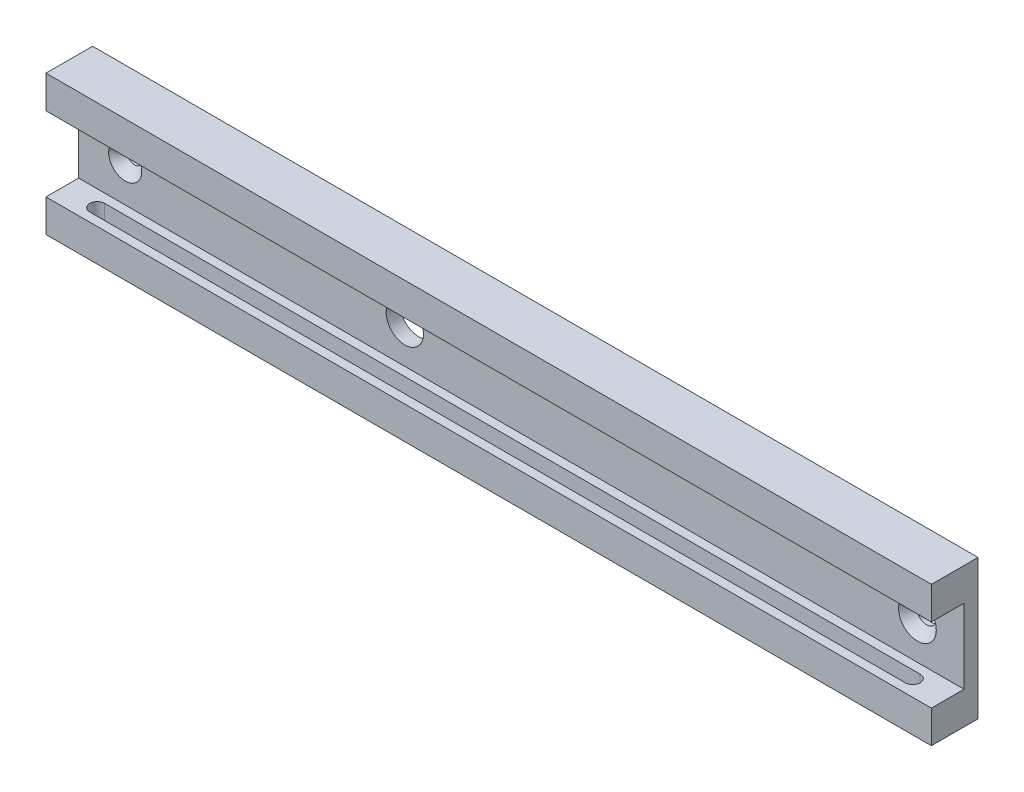
ISO-10303-21;
HEADER;
FILE_DESCRIPTION(('STEP AP214'),'2;1');
FILE_NAME('part.step','',(''),(''),'','','');
FILE_SCHEMA(('AUTOMOTIVE_DESIGN { 1 0 10303 214 1 1 1 1 }'));
ENDSEC;
DATA;
#1=APPLICATION_CONTEXT('core data for automotive mechanical design processes');
#2=APPLICATION_PROTOCOL_DEFINITION('international standard','automotive_design',2000,#1);
#3=PRODUCT_CONTEXT('',#1,'mechanical');
#4=PRODUCT('Part','Part','',(#3));
#5=PRODUCT_RELATED_PRODUCT_CATEGORY('part','',(#4));
#6=PRODUCT_DEFINITION_FORMATION('','',#4);
#7=PRODUCT_DEFINITION_CONTEXT('part definition',#1,'design');
#8=PRODUCT_DEFINITION('design','',#6,#7);
#9=PRODUCT_DEFINITION_SHAPE('','',#8);
#10=(LENGTH_UNIT() NAMED_UNIT(*) SI_UNIT(.MILLI.,.METRE.));
#11=(NAMED_UNIT(*) PLANE_ANGLE_UNIT() SI_UNIT($,.RADIAN.));
#12=(NAMED_UNIT(*) SI_UNIT($,.STERADIAN.) SOLID_ANGLE_UNIT());
#13=UNCERTAINTY_MEASURE_WITH_UNIT(LENGTH_MEASURE(1.E-05),#10,'distance_accuracy_value','');
#14=(GEOMETRIC_REPRESENTATION_CONTEXT(3) GLOBAL_UNCERTAINTY_ASSIGNED_CONTEXT((#13)) GLOBAL_UNIT_ASSIGNED_CONTEXT((#10,
#11,#12)) REPRESENTATION_CONTEXT('',''));
#15=CARTESIAN_POINT('',(0.,0.,0.));
#16=DIRECTION('',(0.,0.,1.));
#17=DIRECTION('',(1.,0.,0.));
#18=AXIS2_PLACEMENT_3D('',#15,#16,#17);
#19=CARTESIAN_POINT('',(0.,0.,10.));
#20=DIRECTION('',(0.,0.,-1.));
#21=DIRECTION('',(-1.,0.,0.));
#22=AXIS2_PLACEMENT_3D('',#19,#20,#21);
#23=PLANE('',#22);
#24=DIRECTION('',(0.,-1.,0.));
#25=VECTOR('',#24,1.);
#26=CARTESIAN_POINT('',(0.,0.,10.));
#27=LINE('',#26,#25);
#28=CARTESIAN_POINT('',(0.,30.,10.));
#29=VERTEX_POINT('',#28);
#30=CARTESIAN_POINT('',(0.,23.,10.));
#31=VERTEX_POINT('',#30);
#32=EDGE_CURVE('E176',#29,#31,#27,.T.);
#33=ORIENTED_EDGE('',*,*,#32,.T.);
#34=DIRECTION('',(1.,0.,0.));
#35=VECTOR('',#34,1.);
#36=CARTESIAN_POINT('',(0.,23.,10.));
#37=LINE('',#36,#35);
#38=CARTESIAN_POINT('',(190.,23.,10.));
#39=VERTEX_POINT('',#38);
#40=EDGE_CURVE('E167',#31,#39,#37,.T.);
#41=ORIENTED_EDGE('',*,*,#40,.T.);
#42=DIRECTION('',(0.,1.,0.));
#43=VECTOR('',#42,1.);
#44=CARTESIAN_POINT('',(190.,0.,10.));
#45=LINE('',#44,#43);
#46=CARTESIAN_POINT('',(190.,30.,10.));
#47=VERTEX_POINT('',#46);
#48=EDGE_CURVE('E182',#39,#47,#45,.T.);
#49=ORIENTED_EDGE('',*,*,#48,.T.);
#50=DIRECTION('',(-1.,0.,0.));
#51=VECTOR('',#50,1.);
#52=CARTESIAN_POINT('',(0.,30.,10.));
#53=LINE('',#52,#51);
#54=EDGE_CURVE('E186',#47,#29,#53,.T.);
#55=ORIENTED_EDGE('',*,*,#54,.T.);
#56=EDGE_LOOP('',(#33,#41,#49,#55));
#57=FACE_BOUND('',#56,.T.);
#58=ADVANCED_FACE('F32',(#57),#23,.F.);
#59=CARTESIAN_POINT('',(0.,0.,10.));
#60=DIRECTION('',(1.,0.,0.));
#61=DIRECTION('',(0.,0.,-1.));
#62=AXIS2_PLACEMENT_3D('',#59,#60,#61);
#63=PLANE('',#62);
#64=DIRECTION('',(0.,1.,0.));
#65=VECTOR('',#64,1.);
#66=CARTESIAN_POINT('',(0.,7.,3.));
#67=LINE('',#66,#65);
#68=CARTESIAN_POINT('',(0.,7.,3.));
#69=VERTEX_POINT('',#68);
#70=CARTESIAN_POINT('',(0.,23.,3.));
#71=VERTEX_POINT('',#70);
#72=EDGE_CURVE('E153',#69,#71,#67,.T.);
#73=ORIENTED_EDGE('',*,*,#72,.T.);
#74=DIRECTION('',(0.,0.,1.));
#75=VECTOR('',#74,1.);
#76=CARTESIAN_POINT('',(0.,23.,10.));
#77=LINE('',#76,#75);
#78=EDGE_CURVE('E157',#71,#31,#77,.T.);
#79=ORIENTED_EDGE('',*,*,#78,.T.);
#80=ORIENTED_EDGE('',*,*,#32,.F.);
#81=DIRECTION('',(0.,0.,-1.));
#82=VECTOR('',#81,1.);
#83=CARTESIAN_POINT('',(0.,30.,10.));
#84=LINE('',#83,#82);
#85=CARTESIAN_POINT('',(0.,30.,0.));
#86=VERTEX_POINT('',#85);
#87=EDGE_CURVE('E188',#29,#86,#84,.T.);
#88=ORIENTED_EDGE('',*,*,#87,.T.);
#89=DIRECTION('',(0.,-1.,0.));
#90=VECTOR('',#89,1.);
#91=CARTESIAN_POINT('',(0.,0.,0.));
#92=LINE('',#91,#90);
#93=CARTESIAN_POINT('',(0.,0.,0.));
#94=VERTEX_POINT('',#93);
#95=EDGE_CURVE('E170',#86,#94,#92,.T.);
#96=ORIENTED_EDGE('',*,*,#95,.T.);
#97=DIRECTION('',(0.,0.,-1.));
#98=VECTOR('',#97,1.);
#99=CARTESIAN_POINT('',(0.,0.,10.));
#100=LINE('',#99,#98);
#101=CARTESIAN_POINT('',(0.,0.,10.));
#102=VERTEX_POINT('',#101);
#103=EDGE_CURVE('E205',#102,#94,#100,.T.);
#104=ORIENTED_EDGE('',*,*,#103,.F.);
#105=CARTESIAN_POINT('',(0.,7.,10.));
#106=VERTEX_POINT('',#105);
#107=EDGE_CURVE('E180',#106,#102,#27,.T.);
#108=ORIENTED_EDGE('',*,*,#107,.F.);
#109=DIRECTION('',(0.,0.,-1.));
#110=VECTOR('',#109,1.);
#111=CARTESIAN_POINT('',(0.,7.,10.));
#112=LINE('',#111,#110);
#113=EDGE_CURVE('E150',#106,#69,#112,.T.);
#114=ORIENTED_EDGE('',*,*,#113,.T.);
#115=EDGE_LOOP('',(#73,#79,#80,#88,#96,#104,#108,#114));
#116=FACE_BOUND('',#115,.T.);
#117=ADVANCED_FACE('F229',(#116),#63,.F.);
#118=CARTESIAN_POINT('',(0.,0.,10.));
#119=DIRECTION('',(0.,1.,0.));
#120=DIRECTION('',(0.,0.,1.));
#121=AXIS2_PLACEMENT_3D('',#118,#119,#120);
#122=PLANE('',#121);
#123=CARTESIAN_POINT('',(182.5,0.,6.50000000000001));
#124=DIRECTION('',(0.,-1.,0.));
#125=DIRECTION('',(0.,0.,-1.));
#126=AXIS2_PLACEMENT_3D('',#123,#124,#125);
#127=CIRCLE('',#126,1.6);
#128=CARTESIAN_POINT('',(182.5,0.,4.90000000000001));
#129=VERTEX_POINT('',#128);
#130=CARTESIAN_POINT('',(182.5,0.,8.10000000000001));
#131=VERTEX_POINT('',#130);
#132=EDGE_CURVE('E329',#129,#131,#127,.T.);
#133=ORIENTED_EDGE('',*,*,#132,.F.);
#134=DIRECTION('',(1.,0.,0.));
#135=VECTOR('',#134,1.);
#136=CARTESIAN_POINT('',(7.50000000000002,0.,4.9));
#137=LINE('',#136,#135);
#138=CARTESIAN_POINT('',(7.50000000000002,0.,4.9));
#139=VERTEX_POINT('',#138);
#140=EDGE_CURVE('E332',#139,#129,#137,.T.);
#141=ORIENTED_EDGE('',*,*,#140,.F.);
#142=CARTESIAN_POINT('',(7.50000000000002,0.,6.5));
#143=DIRECTION('',(0.,-1.,0.));
#144=DIRECTION('',(0.,0.,-1.));
#145=AXIS2_PLACEMENT_3D('',#142,#143,#144);
#146=CIRCLE('',#145,1.6);
#147=CARTESIAN_POINT('',(7.50000000000002,0.,8.1));
#148=VERTEX_POINT('',#147);
#149=EDGE_CURVE('E141',#148,#139,#146,.T.);
#150=ORIENTED_EDGE('',*,*,#149,.F.);
#151=DIRECTION('',(-1.,0.,0.));
#152=VECTOR('',#151,1.);
#153=CARTESIAN_POINT('',(7.50000000000002,0.,8.1));
#154=LINE('',#153,#152);
#155=EDGE_CURVE('E47',#131,#148,#154,.T.);
#156=ORIENTED_EDGE('',*,*,#155,.F.);
#157=EDGE_LOOP('',(#133,#141,#150,#156));
#158=FACE_BOUND('',#157,.T.);
#159=DIRECTION('',(1.,0.,0.));
#160=VECTOR('',#159,1.);
#161=CARTESIAN_POINT('',(0.,0.,0.));
#162=LINE('',#161,#160);
#163=CARTESIAN_POINT('',(190.,0.,0.));
#164=VERTEX_POINT('',#163);
#165=EDGE_CURVE('E191',#94,#164,#162,.T.);
#166=ORIENTED_EDGE('',*,*,#165,.T.);
#167=DIRECTION('',(0.,0.,-1.));
#168=VECTOR('',#167,1.);
#169=CARTESIAN_POINT('',(190.,0.,10.));
#170=LINE('',#169,#168);
#171=CARTESIAN_POINT('',(190.,0.,10.));
#172=VERTEX_POINT('',#171);
#173=EDGE_CURVE('E202',#172,#164,#170,.T.);
#174=ORIENTED_EDGE('',*,*,#173,.F.);
#175=DIRECTION('',(1.,0.,0.));
#176=VECTOR('',#175,1.);
#177=CARTESIAN_POINT('',(0.,0.,10.));
#178=LINE('',#177,#176);
#179=EDGE_CURVE('E179',#102,#172,#178,.T.);
#180=ORIENTED_EDGE('',*,*,#179,.F.);
#181=ORIENTED_EDGE('',*,*,#103,.T.);
#182=EDGE_LOOP('',(#166,#174,#180,#181));
#183=FACE_BOUND('',#182,.T.);
#184=ADVANCED_FACE('F236',(#158,#183),#122,.F.);
#185=CARTESIAN_POINT('',(190.,0.,10.));
#186=DIRECTION('',(-1.,0.,0.));
#187=DIRECTION('',(0.,0.,1.));
#188=AXIS2_PLACEMENT_3D('',#185,#186,#187);
#189=PLANE('',#188);
#190=ORIENTED_EDGE('',*,*,#48,.F.);
#191=DIRECTION('',(0.,0.,1.));
#192=VECTOR('',#191,1.);
#193=CARTESIAN_POINT('',(190.,23.,10.));
#194=LINE('',#193,#192);
#195=CARTESIAN_POINT('',(190.,23.,3.));
#196=VERTEX_POINT('',#195);
#197=EDGE_CURVE('E154',#196,#39,#194,.T.);
#198=ORIENTED_EDGE('',*,*,#197,.F.);
#199=DIRECTION('',(0.,1.,0.));
#200=VECTOR('',#199,1.);
#201=CARTESIAN_POINT('',(190.,7.,3.));
#202=LINE('',#201,#200);
#203=CARTESIAN_POINT('',(190.,7.,3.));
#204=VERTEX_POINT('',#203);
#205=EDGE_CURVE('E163',#204,#196,#202,.T.);
#206=ORIENTED_EDGE('',*,*,#205,.F.);
#207=DIRECTION('',(0.,0.,-1.));
#208=VECTOR('',#207,1.);
#209=CARTESIAN_POINT('',(190.,7.,10.));
#210=LINE('',#209,#208);
#211=CARTESIAN_POINT('',(190.,7.,10.));
#212=VERTEX_POINT('',#211);
#213=EDGE_CURVE('E149',#212,#204,#210,.T.);
#214=ORIENTED_EDGE('',*,*,#213,.F.);
#215=EDGE_CURVE('E183',#172,#212,#45,.T.);
#216=ORIENTED_EDGE('',*,*,#215,.F.);
#217=ORIENTED_EDGE('',*,*,#173,.T.);
#218=DIRECTION('',(0.,1.,0.));
#219=VECTOR('',#218,1.);
#220=CARTESIAN_POINT('',(190.,0.,0.));
#221=LINE('',#220,#219);
#222=CARTESIAN_POINT('',(190.,30.,0.));
#223=VERTEX_POINT('',#222);
#224=EDGE_CURVE('E193',#164,#223,#221,.T.);
#225=ORIENTED_EDGE('',*,*,#224,.T.);
#226=DIRECTION('',(0.,0.,-1.));
#227=VECTOR('',#226,1.);
#228=CARTESIAN_POINT('',(190.,30.,10.));
#229=LINE('',#228,#227);
#230=EDGE_CURVE('E199',#47,#223,#229,.T.);
#231=ORIENTED_EDGE('',*,*,#230,.F.);
#232=EDGE_LOOP('',(#190,#198,#206,#214,#216,#217,#225,#231));
#233=FACE_BOUND('',#232,.T.);
#234=ADVANCED_FACE('F251',(#233),#189,.F.);
#235=CARTESIAN_POINT('',(0.,30.,10.));
#236=DIRECTION('',(0.,-1.,0.));
#237=DIRECTION('',(0.,0.,-1.));
#238=AXIS2_PLACEMENT_3D('',#235,#236,#237);
#239=PLANE('',#238);
#240=DIRECTION('',(-1.,0.,0.));
#241=VECTOR('',#240,1.);
#242=CARTESIAN_POINT('',(0.,30.,0.));
#243=LINE('',#242,#241);
#244=EDGE_CURVE('E195',#223,#86,#243,.T.);
#245=ORIENTED_EDGE('',*,*,#244,.T.);
#246=ORIENTED_EDGE('',*,*,#87,.F.);
#247=ORIENTED_EDGE('',*,*,#54,.F.);
#248=ORIENTED_EDGE('',*,*,#230,.T.);
#249=EDGE_LOOP('',(#245,#246,#247,#248));
#250=FACE_BOUND('',#249,.T.);
#251=ADVANCED_FACE('F243',(#250),#239,.F.);
#252=ORIENTED_EDGE('',*,*,#215,.T.);
#253=DIRECTION('',(1.,0.,0.));
#254=VECTOR('',#253,1.);
#255=CARTESIAN_POINT('',(0.,7.,10.));
#256=LINE('',#255,#254);
#257=EDGE_CURVE('E160',#106,#212,#256,.T.);
#258=ORIENTED_EDGE('',*,*,#257,.F.);
#259=ORIENTED_EDGE('',*,*,#107,.T.);
#260=ORIENTED_EDGE('',*,*,#179,.T.);
#261=EDGE_LOOP('',(#252,#258,#259,#260));
#262=FACE_BOUND('',#261,.T.);
#263=ADVANCED_FACE('F232',(#262),#23,.F.);
#264=CARTESIAN_POINT('',(0.,0.,0.));
#265=DIRECTION('',(0.,0.,-1.));
#266=DIRECTION('',(-1.,0.,0.));
#267=AXIS2_PLACEMENT_3D('',#264,#265,#266);
#268=PLANE('',#267);
#269=CARTESIAN_POINT('',(70.,15.,0.));
#270=DIRECTION('',(0.,0.,1.));
#271=DIRECTION('',(1.,0.,0.));
#272=AXIS2_PLACEMENT_3D('',#269,#270,#271);
#273=CIRCLE('',#272,4.00000000000001);
#274=CARTESIAN_POINT('',(74.,15.,0.));
#275=VERTEX_POINT('',#274);
#276=EDGE_CURVE('E313',#275,#275,#273,.T.);
#277=ORIENTED_EDGE('',*,*,#276,.T.);
#278=EDGE_LOOP('',(#277));
#279=FACE_BOUND('',#278,.T.);
#280=CARTESIAN_POINT('',(10.,15.,0.));
#281=DIRECTION('',(0.,0.,1.));
#282=DIRECTION('',(1.,0.,0.));
#283=AXIS2_PLACEMENT_3D('',#280,#281,#282);
#284=CIRCLE('',#283,1.55);
#285=CARTESIAN_POINT('',(11.55,15.,0.));
#286=VERTEX_POINT('',#285);
#287=EDGE_CURVE('E319',#286,#286,#284,.T.);
#288=ORIENTED_EDGE('',*,*,#287,.T.);
#289=EDGE_LOOP('',(#288));
#290=FACE_BOUND('',#289,.T.);
#291=CARTESIAN_POINT('',(180.,15.,0.));
#292=DIRECTION('',(0.,0.,1.));
#293=DIRECTION('',(1.,0.,0.));
#294=AXIS2_PLACEMENT_3D('',#291,#292,#293);
#295=CIRCLE('',#294,2.04999999999999);
#296=CARTESIAN_POINT('',(182.05,15.,0.));
#297=VERTEX_POINT('',#296);
#298=EDGE_CURVE('E324',#297,#297,#295,.T.);
#299=ORIENTED_EDGE('',*,*,#298,.T.);
#300=EDGE_LOOP('',(#299));
#301=FACE_BOUND('',#300,.T.);
#302=ORIENTED_EDGE('',*,*,#95,.F.);
#303=ORIENTED_EDGE('',*,*,#244,.F.);
#304=ORIENTED_EDGE('',*,*,#224,.F.);
#305=ORIENTED_EDGE('',*,*,#165,.F.);
#306=EDGE_LOOP('',(#302,#303,#304,#305));
#307=FACE_BOUND('',#306,.T.);
#308=ADVANCED_FACE('F242',(#279,#290,#301,#307),#268,.T.);
#309=CARTESIAN_POINT('',(0.,23.,10.));
#310=DIRECTION('',(0.,1.,0.));
#311=DIRECTION('',(0.,0.,1.));
#312=AXIS2_PLACEMENT_3D('',#309,#310,#311);
#313=PLANE('',#312);
#314=ORIENTED_EDGE('',*,*,#197,.T.);
#315=ORIENTED_EDGE('',*,*,#40,.F.);
#316=ORIENTED_EDGE('',*,*,#78,.F.);
#317=DIRECTION('',(1.,0.,0.));
#318=VECTOR('',#317,1.);
#319=CARTESIAN_POINT('',(0.,23.,3.));
#320=LINE('',#319,#318);
#321=EDGE_CURVE('E171',#71,#196,#320,.T.);
#322=ORIENTED_EDGE('',*,*,#321,.T.);
#323=EDGE_LOOP('',(#314,#315,#316,#322));
#324=FACE_BOUND('',#323,.T.);
#325=ADVANCED_FACE('F249',(#324),#313,.F.);
#326=CARTESIAN_POINT('',(0.,7.,3.));
#327=DIRECTION('',(0.,0.,-1.));
#328=DIRECTION('',(0.,1.,0.));
#329=AXIS2_PLACEMENT_3D('',#326,#327,#328);
#330=PLANE('',#329);
#331=CARTESIAN_POINT('',(10.,15.,3.));
#332=DIRECTION('',(0.,0.,-1.));
#333=DIRECTION('',(0.,1.,0.));
#334=AXIS2_PLACEMENT_3D('',#331,#332,#333);
#335=CIRCLE('',#334,3.54999999999997);
#336=CARTESIAN_POINT('',(10.,18.55,3.));
#337=VERTEX_POINT('',#336);
#338=EDGE_CURVE('E11',#337,#337,#335,.T.);
#339=ORIENTED_EDGE('',*,*,#338,.T.);
#340=EDGE_LOOP('',(#339));
#341=FACE_BOUND('',#340,.T.);
#342=CARTESIAN_POINT('',(180.,15.,3.));
#343=DIRECTION('',(0.,0.,-1.));
#344=DIRECTION('',(0.,1.,0.));
#345=AXIS2_PLACEMENT_3D('',#342,#343,#344);
#346=CIRCLE('',#345,4.04999999999997);
#347=CARTESIAN_POINT('',(180.,19.05,3.));
#348=VERTEX_POINT('',#347);
#349=EDGE_CURVE('E211',#348,#348,#346,.T.);
#350=ORIENTED_EDGE('',*,*,#349,.T.);
#351=EDGE_LOOP('',(#350));
#352=FACE_BOUND('',#351,.T.);
#353=CARTESIAN_POINT('',(70.,15.,3.));
#354=DIRECTION('',(0.,0.,1.));
#355=DIRECTION('',(1.,0.,0.));
#356=AXIS2_PLACEMENT_3D('',#353,#354,#355);
#357=CIRCLE('',#356,4.00000000000001);
#358=CARTESIAN_POINT('',(74.,15.,3.));
#359=VERTEX_POINT('',#358);
#360=EDGE_CURVE('E316',#359,#359,#357,.T.);
#361=ORIENTED_EDGE('',*,*,#360,.F.);
#362=EDGE_LOOP('',(#361));
#363=FACE_BOUND('',#362,.T.);
#364=ORIENTED_EDGE('',*,*,#205,.T.);
#365=ORIENTED_EDGE('',*,*,#321,.F.);
#366=ORIENTED_EDGE('',*,*,#72,.F.);
#367=DIRECTION('',(1.,0.,0.));
#368=VECTOR('',#367,1.);
#369=CARTESIAN_POINT('',(0.,7.,3.));
#370=LINE('',#369,#368);
#371=EDGE_CURVE('E173',#69,#204,#370,.T.);
#372=ORIENTED_EDGE('',*,*,#371,.T.);
#373=EDGE_LOOP('',(#364,#365,#366,#372));
#374=FACE_BOUND('',#373,.T.);
#375=ADVANCED_FACE('F278',(#341,#352,#363,#374),#330,.F.);
#376=CARTESIAN_POINT('',(0.,7.,10.));
#377=DIRECTION('',(0.,-1.,0.));
#378=DIRECTION('',(0.,0.,-1.));
#379=AXIS2_PLACEMENT_3D('',#376,#377,#378);
#380=PLANE('',#379);
#381=CARTESIAN_POINT('',(7.50000000000002,7.,6.5));
#382=DIRECTION('',(0.,-1.,0.));
#383=DIRECTION('',(0.,0.,-1.));
#384=AXIS2_PLACEMENT_3D('',#381,#382,#383);
#385=CIRCLE('',#384,1.6);
#386=CARTESIAN_POINT('',(7.50000000000002,7.,4.9));
#387=VERTEX_POINT('',#386);
#388=CARTESIAN_POINT('',(7.50000000000002,7.,8.1));
#389=VERTEX_POINT('',#388);
#390=EDGE_CURVE('E132',#387,#389,#385,.F.);
#391=ORIENTED_EDGE('',*,*,#390,.F.);
#392=DIRECTION('',(-1.,0.,0.));
#393=VECTOR('',#392,1.);
#394=CARTESIAN_POINT('',(7.50000000000002,7.,4.9));
#395=LINE('',#394,#393);
#396=CARTESIAN_POINT('',(182.5,7.,4.90000000000001));
#397=VERTEX_POINT('',#396);
#398=EDGE_CURVE('E55',#397,#387,#395,.T.);
#399=ORIENTED_EDGE('',*,*,#398,.F.);
#400=CARTESIAN_POINT('',(182.5,7.,6.50000000000001));
#401=DIRECTION('',(0.,-1.,0.));
#402=DIRECTION('',(0.,0.,-1.));
#403=AXIS2_PLACEMENT_3D('',#400,#401,#402);
#404=CIRCLE('',#403,1.6);
#405=CARTESIAN_POINT('',(182.5,7.,8.10000000000001));
#406=VERTEX_POINT('',#405);
#407=EDGE_CURVE('E139',#406,#397,#404,.F.);
#408=ORIENTED_EDGE('',*,*,#407,.F.);
#409=DIRECTION('',(1.,0.,0.));
#410=VECTOR('',#409,1.);
#411=CARTESIAN_POINT('',(7.50000000000002,7.,8.1));
#412=LINE('',#411,#410);
#413=EDGE_CURVE('E123',#389,#406,#412,.T.);
#414=ORIENTED_EDGE('',*,*,#413,.F.);
#415=EDGE_LOOP('',(#391,#399,#408,#414));
#416=FACE_BOUND('',#415,.T.);
#417=ORIENTED_EDGE('',*,*,#213,.T.);
#418=ORIENTED_EDGE('',*,*,#371,.F.);
#419=ORIENTED_EDGE('',*,*,#113,.F.);
#420=ORIENTED_EDGE('',*,*,#257,.T.);
#421=EDGE_LOOP('',(#417,#418,#419,#420));
#422=FACE_BOUND('',#421,.T.);
#423=ADVANCED_FACE('F136',(#416,#422),#380,.F.);
#424=CARTESIAN_POINT('',(7.50000000000002,30.001,4.9));
#425=DIRECTION('',(0.,0.,-1.));
#426=DIRECTION('',(-1.,0.,0.));
#427=AXIS2_PLACEMENT_3D('',#424,#425,#426);
#428=PLANE('',#427);
#429=ORIENTED_EDGE('',*,*,#398,.T.);
#430=DIRECTION('',(0.,-1.,0.));
#431=VECTOR('',#430,1.);
#432=CARTESIAN_POINT('',(7.50000000000002,30.001,4.9));
#433=LINE('',#432,#431);
#434=EDGE_CURVE('E128',#387,#139,#433,.T.);
#435=ORIENTED_EDGE('',*,*,#434,.T.);
#436=ORIENTED_EDGE('',*,*,#140,.T.);
#437=DIRECTION('',(0.,-1.,0.));
#438=VECTOR('',#437,1.);
#439=CARTESIAN_POINT('',(182.5,30.001,4.90000000000001));
#440=LINE('',#439,#438);
#441=EDGE_CURVE('E146',#397,#129,#440,.T.);
#442=ORIENTED_EDGE('',*,*,#441,.F.);
#443=EDGE_LOOP('',(#429,#435,#436,#442));
#444=FACE_BOUND('',#443,.T.);
#445=ADVANCED_FACE('F286',(#444),#428,.F.);
#446=CARTESIAN_POINT('',(182.5,30.001,6.50000000000001));
#447=DIRECTION('',(0.,-1.,0.));
#448=DIRECTION('',(0.,0.,-1.));
#449=AXIS2_PLACEMENT_3D('',#446,#447,#448);
#450=CYLINDRICAL_SURFACE('',#449,1.6);
#451=ORIENTED_EDGE('',*,*,#407,.T.);
#452=ORIENTED_EDGE('',*,*,#441,.T.);
#453=ORIENTED_EDGE('',*,*,#132,.T.);
#454=DIRECTION('',(0.,-1.,0.));
#455=VECTOR('',#454,1.);
#456=CARTESIAN_POINT('',(182.5,30.001,8.10000000000001));
#457=LINE('',#456,#455);
#458=EDGE_CURVE('E129',#406,#131,#457,.T.);
#459=ORIENTED_EDGE('',*,*,#458,.F.);
#460=EDGE_LOOP('',(#451,#452,#453,#459));
#461=FACE_BOUND('',#460,.T.);
#462=ADVANCED_FACE('F292',(#461),#450,.F.);
#463=CARTESIAN_POINT('',(7.50000000000002,30.001,8.1));
#464=DIRECTION('',(0.,0.,1.));
#465=DIRECTION('',(1.,0.,0.));
#466=AXIS2_PLACEMENT_3D('',#463,#464,#465);
#467=PLANE('',#466);
#468=ORIENTED_EDGE('',*,*,#413,.T.);
#469=ORIENTED_EDGE('',*,*,#458,.T.);
#470=ORIENTED_EDGE('',*,*,#155,.T.);
#471=DIRECTION('',(0.,-1.,0.));
#472=VECTOR('',#471,1.);
#473=CARTESIAN_POINT('',(7.50000000000002,30.001,8.1));
#474=LINE('',#473,#472);
#475=EDGE_CURVE('E119',#389,#148,#474,.T.);
#476=ORIENTED_EDGE('',*,*,#475,.F.);
#477=EDGE_LOOP('',(#468,#469,#470,#476));
#478=FACE_BOUND('',#477,.T.);
#479=ADVANCED_FACE('F121',(#478),#467,.F.);
#480=CARTESIAN_POINT('',(7.50000000000002,30.001,6.5));
#481=DIRECTION('',(0.,-1.,0.));
#482=DIRECTION('',(0.,0.,-1.));
#483=AXIS2_PLACEMENT_3D('',#480,#481,#482);
#484=CYLINDRICAL_SURFACE('',#483,1.6);
#485=ORIENTED_EDGE('',*,*,#390,.T.);
#486=ORIENTED_EDGE('',*,*,#475,.T.);
#487=ORIENTED_EDGE('',*,*,#149,.T.);
#488=ORIENTED_EDGE('',*,*,#434,.F.);
#489=EDGE_LOOP('',(#485,#486,#487,#488));
#490=FACE_BOUND('',#489,.T.);
#491=ADVANCED_FACE('F133',(#490),#484,.F.);
#492=CARTESIAN_POINT('',(180.,15.,0.));
#493=DIRECTION('',(0.,0.,1.));
#494=DIRECTION('',(1.,0.,0.));
#495=AXIS2_PLACEMENT_3D('',#492,#493,#494);
#496=CYLINDRICAL_SURFACE('',#495,2.04999999999999);
#497=CARTESIAN_POINT('',(180.,15.,1.00000000000002));
#498=DIRECTION('',(0.,0.,-1.));
#499=DIRECTION('',(-1.,0.,0.));
#500=AXIS2_PLACEMENT_3D('',#497,#498,#499);
#501=CIRCLE('',#500,2.04999999999999);
#502=CARTESIAN_POINT('',(177.95,15.,1.00000000000002));
#503=VERTEX_POINT('',#502);
#504=EDGE_CURVE('E208',#503,#503,#501,.F.);
#505=ORIENTED_EDGE('',*,*,#504,.T.);
#506=EDGE_LOOP('',(#505));
#507=FACE_BOUND('',#506,.T.);
#508=ORIENTED_EDGE('',*,*,#298,.F.);
#509=EDGE_LOOP('',(#508));
#510=FACE_BOUND('',#509,.T.);
#511=ADVANCED_FACE('F300',(#507,#510),#496,.F.);
#512=CARTESIAN_POINT('',(10.,15.,0.));
#513=DIRECTION('',(0.,0.,1.));
#514=DIRECTION('',(1.,0.,0.));
#515=AXIS2_PLACEMENT_3D('',#512,#513,#514);
#516=CYLINDRICAL_SURFACE('',#515,1.55);
#517=CARTESIAN_POINT('',(10.,15.,1.00000000000002));
#518=DIRECTION('',(0.,0.,-1.));
#519=DIRECTION('',(-1.,0.,0.));
#520=AXIS2_PLACEMENT_3D('',#517,#518,#519);
#521=CIRCLE('',#520,1.55);
#522=CARTESIAN_POINT('',(8.45000000000001,15.,1.00000000000002));
#523=VERTEX_POINT('',#522);
#524=EDGE_CURVE('E40',#523,#523,#521,.F.);
#525=ORIENTED_EDGE('',*,*,#524,.T.);
#526=EDGE_LOOP('',(#525));
#527=FACE_BOUND('',#526,.T.);
#528=ORIENTED_EDGE('',*,*,#287,.F.);
#529=EDGE_LOOP('',(#528));
#530=FACE_BOUND('',#529,.T.);
#531=ADVANCED_FACE('F216',(#527,#530),#516,.F.);
#532=CARTESIAN_POINT('',(70.,15.,0.));
#533=DIRECTION('',(0.,0.,1.));
#534=DIRECTION('',(1.,0.,0.));
#535=AXIS2_PLACEMENT_3D('',#532,#533,#534);
#536=CYLINDRICAL_SURFACE('',#535,4.00000000000001);
#537=ORIENTED_EDGE('',*,*,#276,.F.);
#538=EDGE_LOOP('',(#537));
#539=FACE_BOUND('',#538,.T.);
#540=ORIENTED_EDGE('',*,*,#360,.T.);
#541=EDGE_LOOP('',(#540));
#542=FACE_BOUND('',#541,.T.);
#543=ADVANCED_FACE('F225',(#539,#542),#536,.F.);
#544=CARTESIAN_POINT('',(180.,15.,1.00000000000002));
#545=DIRECTION('',(0.,0.,1.));
#546=DIRECTION('',(1.,0.,0.));
#547=AXIS2_PLACEMENT_3D('',#544,#545,#546);
#548=CONICAL_SURFACE('',#547,2.04999999999999,0.785398163397447);
#549=ORIENTED_EDGE('',*,*,#349,.F.);
#550=EDGE_LOOP('',(#549));
#551=FACE_BOUND('',#550,.T.);
#552=ORIENTED_EDGE('',*,*,#504,.F.);
#553=EDGE_LOOP('',(#552));
#554=FACE_BOUND('',#553,.T.);
#555=ADVANCED_FACE('F220',(#551,#554),#548,.F.);
#556=CARTESIAN_POINT('',(10.,15.,1.00000000000002));
#557=DIRECTION('',(0.,0.,1.));
#558=DIRECTION('',(1.,0.,0.));
#559=AXIS2_PLACEMENT_3D('',#556,#557,#558);
#560=CONICAL_SURFACE('',#559,1.55,0.785398163397447);
#561=ORIENTED_EDGE('',*,*,#338,.F.);
#562=EDGE_LOOP('',(#561));
#563=FACE_BOUND('',#562,.T.);
#564=ORIENTED_EDGE('',*,*,#524,.F.);
#565=EDGE_LOOP('',(#564));
#566=FACE_BOUND('',#565,.T.);
#567=ADVANCED_FACE('F34',(#563,#566),#560,.F.);
#568=CLOSED_SHELL('',(#58,#117,#184,#234,#251,#263,#308,#325,#375,#423,#445,#462,#479,#491,#511,
#531,#543,#555,#567));
#569=MANIFOLD_SOLID_BREP('B2',#568);
#570=ADVANCED_BREP_SHAPE_REPRESENTATION('',(#18,#569),#14);
#571=SHAPE_DEFINITION_REPRESENTATION(#9,#570);
ENDSEC;
END-ISO-10303-21;
